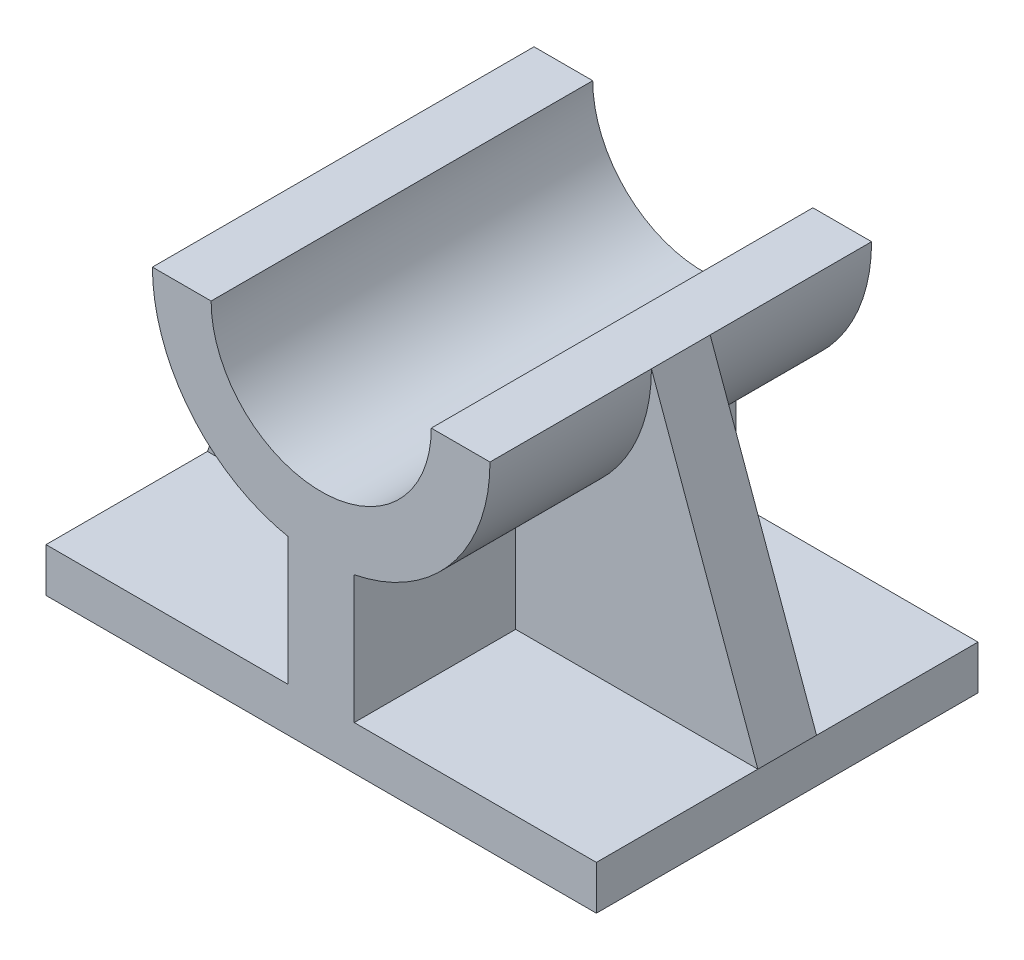
ISO-10303-21;
HEADER;
FILE_DESCRIPTION(('STEP AP214'),'2;1');
FILE_NAME('part.step','',(''),(''),'','','');
FILE_SCHEMA(('AUTOMOTIVE_DESIGN { 1 0 10303 214 1 1 1 1 }'));
ENDSEC;
DATA;
#1=APPLICATION_CONTEXT('core data for automotive mechanical design processes');
#2=APPLICATION_PROTOCOL_DEFINITION('international standard','automotive_design',2000,#1);
#3=PRODUCT_CONTEXT('',#1,'mechanical');
#4=PRODUCT('Part','Part','',(#3));
#5=PRODUCT_RELATED_PRODUCT_CATEGORY('part','',(#4));
#6=PRODUCT_DEFINITION_FORMATION('','',#4);
#7=PRODUCT_DEFINITION_CONTEXT('part definition',#1,'design');
#8=PRODUCT_DEFINITION('design','',#6,#7);
#9=PRODUCT_DEFINITION_SHAPE('','',#8);
#10=(LENGTH_UNIT() NAMED_UNIT(*) SI_UNIT(.MILLI.,.METRE.));
#11=(NAMED_UNIT(*) PLANE_ANGLE_UNIT() SI_UNIT($,.RADIAN.));
#12=(NAMED_UNIT(*) SI_UNIT($,.STERADIAN.) SOLID_ANGLE_UNIT());
#13=UNCERTAINTY_MEASURE_WITH_UNIT(LENGTH_MEASURE(1.E-05),#10,'distance_accuracy_value','');
#14=(GEOMETRIC_REPRESENTATION_CONTEXT(3) GLOBAL_UNCERTAINTY_ASSIGNED_CONTEXT((#13)) GLOBAL_UNIT_ASSIGNED_CONTEXT((#10,
#11,#12)) REPRESENTATION_CONTEXT('',''));
#15=CARTESIAN_POINT('',(0.,0.,0.));
#16=DIRECTION('',(0.,0.,1.));
#17=DIRECTION('',(1.,0.,0.));
#18=AXIS2_PLACEMENT_3D('',#15,#16,#17);
#19=CARTESIAN_POINT('',(0.,46.,-26.));
#20=DIRECTION('',(0.,0.,1.));
#21=DIRECTION('',(1.,0.,0.));
#22=AXIS2_PLACEMENT_3D('',#19,#20,#21);
#23=CYLINDRICAL_SURFACE('',#22,23.);
#24=DIRECTION('',(0.,0.,1.));
#25=VECTOR('',#24,1.);
#26=CARTESIAN_POINT('',(-4.5,23.4445128627201,-26.));
#27=LINE('',#26,#25);
#28=CARTESIAN_POINT('',(-4.5,23.4445128627201,-4.));
#29=VERTEX_POINT('',#28);
#30=CARTESIAN_POINT('',(-4.5,23.4445128627201,-26.));
#31=VERTEX_POINT('',#30);
#32=EDGE_CURVE('E201',#29,#31,#27,.F.);
#33=ORIENTED_EDGE('',*,*,#32,.F.);
#34=CARTESIAN_POINT('',(0.,46.,-4.));
#35=DIRECTION('',(0.,0.,1.));
#36=DIRECTION('',(1.,0.,0.));
#37=AXIS2_PLACEMENT_3D('',#34,#35,#36);
#38=CIRCLE('',#37,23.);
#39=CARTESIAN_POINT('',(-23.,46.,-4.));
#40=VERTEX_POINT('',#39);
#41=EDGE_CURVE('E191',#29,#40,#38,.F.);
#42=ORIENTED_EDGE('',*,*,#41,.T.);
#43=DIRECTION('',(0.,0.,1.));
#44=VECTOR('',#43,1.);
#45=CARTESIAN_POINT('',(-23.,46.,-26.));
#46=LINE('',#45,#44);
#47=CARTESIAN_POINT('',(-23.,46.,-26.));
#48=VERTEX_POINT('',#47);
#49=EDGE_CURVE('E185',#48,#40,#46,.T.);
#50=ORIENTED_EDGE('',*,*,#49,.F.);
#51=CARTESIAN_POINT('',(0.,46.,-26.));
#52=DIRECTION('',(0.,0.,1.));
#53=DIRECTION('',(1.,0.,0.));
#54=AXIS2_PLACEMENT_3D('',#51,#52,#53);
#55=CIRCLE('',#54,23.);
#56=EDGE_CURVE('E228',#48,#31,#55,.T.);
#57=ORIENTED_EDGE('',*,*,#56,.T.);
#58=EDGE_LOOP('',(#33,#42,#50,#57));
#59=FACE_BOUND('',#58,.T.);
#60=ADVANCED_FACE('F39',(#59),#23,.T.);
#61=CARTESIAN_POINT('',(0.,6.,0.));
#62=DIRECTION('',(0.,1.,0.));
#63=DIRECTION('',(0.,0.,1.));
#64=AXIS2_PLACEMENT_3D('',#61,#62,#63);
#65=PLANE('',#64);
#66=DIRECTION('',(0.,0.,1.));
#67=VECTOR('',#66,1.);
#68=CARTESIAN_POINT('',(-37.5,6.,-26.));
#69=LINE('',#68,#67);
#70=CARTESIAN_POINT('',(-37.5,6.,-26.));
#71=VERTEX_POINT('',#70);
#72=CARTESIAN_POINT('',(-37.5,6.00000000000002,-4.));
#73=VERTEX_POINT('',#72);
#74=EDGE_CURVE('E274',#71,#73,#69,.T.);
#75=ORIENTED_EDGE('',*,*,#74,.T.);
#76=DIRECTION('',(1.,0.,0.));
#77=VECTOR('',#76,1.);
#78=CARTESIAN_POINT('',(0.,6.,-4.));
#79=LINE('',#78,#77);
#80=CARTESIAN_POINT('',(-4.5,6.,-4.));
#81=VERTEX_POINT('',#80);
#82=EDGE_CURVE('E194',#73,#81,#79,.T.);
#83=ORIENTED_EDGE('',*,*,#82,.T.);
#84=DIRECTION('',(0.,0.,1.));
#85=VECTOR('',#84,1.);
#86=CARTESIAN_POINT('',(-4.5,6.,-26.));
#87=LINE('',#86,#85);
#88=CARTESIAN_POINT('',(-4.5,6.,-26.));
#89=VERTEX_POINT('',#88);
#90=EDGE_CURVE('E237',#89,#81,#87,.T.);
#91=ORIENTED_EDGE('',*,*,#90,.F.);
#92=DIRECTION('',(-1.,0.,0.));
#93=VECTOR('',#92,1.);
#94=CARTESIAN_POINT('',(-37.5,6.,-26.));
#95=LINE('',#94,#93);
#96=EDGE_CURVE('E267',#89,#71,#95,.T.);
#97=ORIENTED_EDGE('',*,*,#96,.T.);
#98=EDGE_LOOP('',(#75,#83,#91,#97));
#99=FACE_BOUND('',#98,.T.);
#100=ADVANCED_FACE('F445',(#99),#65,.T.);
#101=CARTESIAN_POINT('',(-4.5,23.,-26.));
#102=DIRECTION('',(1.,0.,0.));
#103=DIRECTION('',(0.,0.,-1.));
#104=AXIS2_PLACEMENT_3D('',#101,#102,#103);
#105=PLANE('',#104);
#106=DIRECTION('',(0.,-1.,0.));
#107=VECTOR('',#106,1.);
#108=CARTESIAN_POINT('',(-4.5,23.,-4.));
#109=LINE('',#108,#107);
#110=EDGE_CURVE('E203',#29,#81,#109,.T.);
#111=ORIENTED_EDGE('',*,*,#110,.F.);
#112=ORIENTED_EDGE('',*,*,#32,.T.);
#113=DIRECTION('',(0.,-1.,0.));
#114=VECTOR('',#113,1.);
#115=CARTESIAN_POINT('',(-4.5,23.,-26.));
#116=LINE('',#115,#114);
#117=EDGE_CURVE('E246',#31,#89,#116,.T.);
#118=ORIENTED_EDGE('',*,*,#117,.T.);
#119=ORIENTED_EDGE('',*,*,#90,.T.);
#120=EDGE_LOOP('',(#111,#112,#118,#119));
#121=FACE_BOUND('',#120,.T.);
#122=ADVANCED_FACE('F443',(#121),#105,.F.);
#123=DIRECTION('',(0.,0.,-1.));
#124=VECTOR('',#123,1.);
#125=CARTESIAN_POINT('',(4.5,6.,-26.));
#126=LINE('',#125,#124);
#127=CARTESIAN_POINT('',(4.5,6.,-4.00000000000001));
#128=VERTEX_POINT('',#127);
#129=CARTESIAN_POINT('',(4.5,6.,-26.));
#130=VERTEX_POINT('',#129);
#131=EDGE_CURVE('E241',#128,#130,#126,.T.);
#132=ORIENTED_EDGE('',*,*,#131,.F.);
#133=DIRECTION('',(1.,0.,0.));
#134=VECTOR('',#133,1.);
#135=CARTESIAN_POINT('',(0.,6.,-4.));
#136=LINE('',#135,#134);
#137=CARTESIAN_POINT('',(37.5,6.,-4.00000000000001));
#138=VERTEX_POINT('',#137);
#139=EDGE_CURVE('E63',#128,#138,#136,.T.);
#140=ORIENTED_EDGE('',*,*,#139,.T.);
#141=DIRECTION('',(0.,0.,-1.));
#142=VECTOR('',#141,1.);
#143=CARTESIAN_POINT('',(37.5,6.,-26.));
#144=LINE('',#143,#142);
#145=CARTESIAN_POINT('',(37.5,6.,-26.));
#146=VERTEX_POINT('',#145);
#147=EDGE_CURVE('E268',#138,#146,#144,.T.);
#148=ORIENTED_EDGE('',*,*,#147,.T.);
#149=EDGE_CURVE('E269',#146,#130,#95,.T.);
#150=ORIENTED_EDGE('',*,*,#149,.T.);
#151=EDGE_LOOP('',(#132,#140,#148,#150));
#152=FACE_BOUND('',#151,.T.);
#153=ADVANCED_FACE('F417',(#152),#65,.T.);
#154=CARTESIAN_POINT('',(4.5,23.,-26.));
#155=DIRECTION('',(-1.,0.,0.));
#156=DIRECTION('',(0.,0.,1.));
#157=AXIS2_PLACEMENT_3D('',#154,#155,#156);
#158=PLANE('',#157);
#159=DIRECTION('',(0.,1.,0.));
#160=VECTOR('',#159,1.);
#161=CARTESIAN_POINT('',(4.5,23.,-4.));
#162=LINE('',#161,#160);
#163=CARTESIAN_POINT('',(4.5,23.4445128627201,-4.00000000000001));
#164=VERTEX_POINT('',#163);
#165=EDGE_CURVE('E352',#128,#164,#162,.T.);
#166=ORIENTED_EDGE('',*,*,#165,.F.);
#167=ORIENTED_EDGE('',*,*,#131,.T.);
#168=DIRECTION('',(0.,-1.,0.));
#169=VECTOR('',#168,1.);
#170=CARTESIAN_POINT('',(4.5,23.,-26.));
#171=LINE('',#170,#169);
#172=CARTESIAN_POINT('',(4.5,23.4445128627201,-26.));
#173=VERTEX_POINT('',#172);
#174=EDGE_CURVE('E250',#173,#130,#171,.T.);
#175=ORIENTED_EDGE('',*,*,#174,.F.);
#176=DIRECTION('',(0.,0.,1.));
#177=VECTOR('',#176,1.);
#178=CARTESIAN_POINT('',(4.5,23.4445128627201,-26.));
#179=LINE('',#178,#177);
#180=EDGE_CURVE('E231',#173,#164,#179,.T.);
#181=ORIENTED_EDGE('',*,*,#180,.T.);
#182=EDGE_LOOP('',(#166,#167,#175,#181));
#183=FACE_BOUND('',#182,.T.);
#184=ADVANCED_FACE('F415',(#183),#158,.F.);
#185=DIRECTION('',(0.,0.,1.));
#186=VECTOR('',#185,1.);
#187=CARTESIAN_POINT('',(23.,46.,-26.));
#188=LINE('',#187,#186);
#189=CARTESIAN_POINT('',(23.,46.,-26.));
#190=VERTEX_POINT('',#189);
#191=CARTESIAN_POINT('',(23.,46.,-4.00000000000001));
#192=VERTEX_POINT('',#191);
#193=EDGE_CURVE('E215',#190,#192,#188,.T.);
#194=ORIENTED_EDGE('',*,*,#193,.T.);
#195=CARTESIAN_POINT('',(0.,46.,-4.));
#196=DIRECTION('',(0.,0.,1.));
#197=DIRECTION('',(1.,0.,0.));
#198=AXIS2_PLACEMENT_3D('',#195,#196,#197);
#199=CIRCLE('',#198,23.);
#200=EDGE_CURVE('E347',#192,#164,#199,.F.);
#201=ORIENTED_EDGE('',*,*,#200,.T.);
#202=ORIENTED_EDGE('',*,*,#180,.F.);
#203=EDGE_CURVE('E382',#173,#190,#55,.T.);
#204=ORIENTED_EDGE('',*,*,#203,.T.);
#205=EDGE_LOOP('',(#194,#201,#202,#204));
#206=FACE_BOUND('',#205,.T.);
#207=ADVANCED_FACE('F408',(#206),#23,.T.);
#208=CARTESIAN_POINT('',(0.,46.,4.));
#209=DIRECTION('',(0.,0.,1.));
#210=DIRECTION('',(1.,0.,0.));
#211=AXIS2_PLACEMENT_3D('',#208,#209,#210);
#212=CIRCLE('',#211,23.);
#213=CARTESIAN_POINT('',(-4.5,23.4445128627201,4.));
#214=VERTEX_POINT('',#213);
#215=CARTESIAN_POINT('',(-23.,46.,3.99999999999999));
#216=VERTEX_POINT('',#215);
#217=EDGE_CURVE('E447',#214,#216,#212,.F.);
#218=ORIENTED_EDGE('',*,*,#217,.F.);
#219=CARTESIAN_POINT('',(-4.5,23.4445128627201,26.));
#220=VERTEX_POINT('',#219);
#221=EDGE_CURVE('E371',#220,#214,#27,.F.);
#222=ORIENTED_EDGE('',*,*,#221,.F.);
#223=CARTESIAN_POINT('',(0.,46.,26.));
#224=DIRECTION('',(0.,0.,1.));
#225=DIRECTION('',(1.,0.,0.));
#226=AXIS2_PLACEMENT_3D('',#223,#224,#225);
#227=CIRCLE('',#226,23.);
#228=CARTESIAN_POINT('',(-23.,46.,26.));
#229=VERTEX_POINT('',#228);
#230=EDGE_CURVE('E393',#229,#220,#227,.T.);
#231=ORIENTED_EDGE('',*,*,#230,.F.);
#232=EDGE_CURVE('E186',#216,#229,#46,.T.);
#233=ORIENTED_EDGE('',*,*,#232,.F.);
#234=EDGE_LOOP('',(#218,#222,#231,#233));
#235=FACE_BOUND('',#234,.T.);
#236=ADVANCED_FACE('F473',(#235),#23,.T.);
#237=DIRECTION('',(1.,0.,0.));
#238=VECTOR('',#237,1.);
#239=CARTESIAN_POINT('',(0.,6.,4.));
#240=LINE('',#239,#238);
#241=CARTESIAN_POINT('',(-37.5,6.00000000000002,4.));
#242=VERTEX_POINT('',#241);
#243=CARTESIAN_POINT('',(-4.5,6.,4.));
#244=VERTEX_POINT('',#243);
#245=EDGE_CURVE('E457',#242,#244,#240,.T.);
#246=ORIENTED_EDGE('',*,*,#245,.F.);
#247=CARTESIAN_POINT('',(-37.5,6.,26.));
#248=VERTEX_POINT('',#247);
#249=EDGE_CURVE('E273',#242,#248,#69,.T.);
#250=ORIENTED_EDGE('',*,*,#249,.T.);
#251=DIRECTION('',(1.,0.,0.));
#252=VECTOR('',#251,1.);
#253=CARTESIAN_POINT('',(-37.5,6.,26.));
#254=LINE('',#253,#252);
#255=CARTESIAN_POINT('',(-4.5,6.,26.));
#256=VERTEX_POINT('',#255);
#257=EDGE_CURVE('E279',#248,#256,#254,.T.);
#258=ORIENTED_EDGE('',*,*,#257,.T.);
#259=EDGE_CURVE('E235',#244,#256,#87,.T.);
#260=ORIENTED_EDGE('',*,*,#259,.F.);
#261=EDGE_LOOP('',(#246,#250,#258,#260));
#262=FACE_BOUND('',#261,.T.);
#263=ADVANCED_FACE('F468',(#262),#65,.T.);
#264=CARTESIAN_POINT('',(37.5,6.,-26.));
#265=DIRECTION('',(-1.,0.,0.));
#266=DIRECTION('',(0.,0.,1.));
#267=AXIS2_PLACEMENT_3D('',#264,#265,#266);
#268=PLANE('',#267);
#269=DIRECTION('',(0.,0.,-1.));
#270=VECTOR('',#269,1.);
#271=CARTESIAN_POINT('',(37.5,0.,-26.));
#272=LINE('',#271,#270);
#273=CARTESIAN_POINT('',(37.5,0.,26.));
#274=VERTEX_POINT('',#273);
#275=CARTESIAN_POINT('',(37.5,0.,-26.));
#276=VERTEX_POINT('',#275);
#277=EDGE_CURVE('E262',#274,#276,#272,.T.);
#278=ORIENTED_EDGE('',*,*,#277,.T.);
#279=DIRECTION('',(0.,-1.,0.));
#280=VECTOR('',#279,1.);
#281=CARTESIAN_POINT('',(37.5,6.,-26.));
#282=LINE('',#281,#280);
#283=EDGE_CURVE('E11',#146,#276,#282,.T.);
#284=ORIENTED_EDGE('',*,*,#283,.F.);
#285=ORIENTED_EDGE('',*,*,#147,.F.);
#286=DIRECTION('',(0.,0.,1.));
#287=VECTOR('',#286,1.);
#288=CARTESIAN_POINT('',(37.5,6.,0.));
#289=LINE('',#288,#287);
#290=CARTESIAN_POINT('',(37.5,6.,3.99999999999999));
#291=VERTEX_POINT('',#290);
#292=EDGE_CURVE('E326',#291,#138,#289,.F.);
#293=ORIENTED_EDGE('',*,*,#292,.F.);
#294=CARTESIAN_POINT('',(37.5,6.,26.));
#295=VERTEX_POINT('',#294);
#296=EDGE_CURVE('E263',#295,#291,#144,.T.);
#297=ORIENTED_EDGE('',*,*,#296,.F.);
#298=DIRECTION('',(0.,-1.,0.));
#299=VECTOR('',#298,1.);
#300=CARTESIAN_POINT('',(37.5,6.,26.));
#301=LINE('',#300,#299);
#302=EDGE_CURVE('E283',#295,#274,#301,.T.);
#303=ORIENTED_EDGE('',*,*,#302,.T.);
#304=EDGE_LOOP('',(#278,#284,#285,#293,#297,#303));
#305=FACE_BOUND('',#304,.T.);
#306=ADVANCED_FACE('F41',(#305),#268,.F.);
#307=CARTESIAN_POINT('',(-37.5,6.,-26.));
#308=DIRECTION('',(0.,0.,1.));
#309=DIRECTION('',(1.,0.,0.));
#310=AXIS2_PLACEMENT_3D('',#307,#308,#309);
#311=PLANE('',#310);
#312=ORIENTED_EDGE('',*,*,#117,.F.);
#313=ORIENTED_EDGE('',*,*,#56,.F.);
#314=DIRECTION('',(-1.,0.,0.));
#315=VECTOR('',#314,1.);
#316=CARTESIAN_POINT('',(-23.,46.,-26.));
#317=LINE('',#316,#315);
#318=CARTESIAN_POINT('',(-15.,46.,-26.));
#319=VERTEX_POINT('',#318);
#320=EDGE_CURVE('E209',#319,#48,#317,.T.);
#321=ORIENTED_EDGE('',*,*,#320,.F.);
#322=CARTESIAN_POINT('',(0.,46.,-26.));
#323=DIRECTION('',(0.,0.,-1.));
#324=DIRECTION('',(1.,0.,0.));
#325=AXIS2_PLACEMENT_3D('',#322,#323,#324);
#326=CIRCLE('',#325,15.);
#327=CARTESIAN_POINT('',(15.,46.,-26.));
#328=VERTEX_POINT('',#327);
#329=EDGE_CURVE('E376',#328,#319,#326,.T.);
#330=ORIENTED_EDGE('',*,*,#329,.F.);
#331=DIRECTION('',(-1.,0.,0.));
#332=VECTOR('',#331,1.);
#333=CARTESIAN_POINT('',(15.,46.,-26.));
#334=LINE('',#333,#332);
#335=EDGE_CURVE('E222',#190,#328,#334,.T.);
#336=ORIENTED_EDGE('',*,*,#335,.F.);
#337=ORIENTED_EDGE('',*,*,#203,.F.);
#338=ORIENTED_EDGE('',*,*,#174,.T.);
#339=ORIENTED_EDGE('',*,*,#149,.F.);
#340=ORIENTED_EDGE('',*,*,#283,.T.);
#341=DIRECTION('',(-1.,0.,0.));
#342=VECTOR('',#341,1.);
#343=CARTESIAN_POINT('',(-37.5,0.,-26.));
#344=LINE('',#343,#342);
#345=CARTESIAN_POINT('',(-37.5,0.,-26.));
#346=VERTEX_POINT('',#345);
#347=EDGE_CURVE('E286',#276,#346,#344,.T.);
#348=ORIENTED_EDGE('',*,*,#347,.T.);
#349=DIRECTION('',(0.,-1.,0.));
#350=VECTOR('',#349,1.);
#351=CARTESIAN_POINT('',(-37.5,6.,-26.));
#352=LINE('',#351,#350);
#353=EDGE_CURVE('E48',#71,#346,#352,.T.);
#354=ORIENTED_EDGE('',*,*,#353,.F.);
#355=ORIENTED_EDGE('',*,*,#96,.F.);
#356=EDGE_LOOP('',(#312,#313,#321,#330,#336,#337,#338,#339,#340,#348,#354,#355));
#357=FACE_BOUND('',#356,.T.);
#358=ADVANCED_FACE('F438',(#357),#311,.F.);
#359=CARTESIAN_POINT('',(-37.5,6.,-26.));
#360=DIRECTION('',(1.,0.,0.));
#361=DIRECTION('',(0.,0.,-1.));
#362=AXIS2_PLACEMENT_3D('',#359,#360,#361);
#363=PLANE('',#362);
#364=ORIENTED_EDGE('',*,*,#249,.F.);
#365=DIRECTION('',(0.,0.,1.));
#366=VECTOR('',#365,1.);
#367=CARTESIAN_POINT('',(-37.5,6.00000000000002,-26.));
#368=LINE('',#367,#366);
#369=EDGE_CURVE('E354',#73,#242,#368,.T.);
#370=ORIENTED_EDGE('',*,*,#369,.F.);
#371=ORIENTED_EDGE('',*,*,#74,.F.);
#372=ORIENTED_EDGE('',*,*,#353,.T.);
#373=DIRECTION('',(0.,0.,1.));
#374=VECTOR('',#373,1.);
#375=CARTESIAN_POINT('',(-37.5,0.,-26.));
#376=LINE('',#375,#374);
#377=CARTESIAN_POINT('',(-37.5,0.,26.));
#378=VERTEX_POINT('',#377);
#379=EDGE_CURVE('E289',#346,#378,#376,.T.);
#380=ORIENTED_EDGE('',*,*,#379,.T.);
#381=DIRECTION('',(0.,-1.,0.));
#382=VECTOR('',#381,1.);
#383=CARTESIAN_POINT('',(-37.5,6.,26.));
#384=LINE('',#383,#382);
#385=EDGE_CURVE('E298',#248,#378,#384,.T.);
#386=ORIENTED_EDGE('',*,*,#385,.F.);
#387=EDGE_LOOP('',(#364,#370,#371,#372,#380,#386));
#388=FACE_BOUND('',#387,.T.);
#389=ADVANCED_FACE('F308',(#388),#363,.F.);
#390=CARTESIAN_POINT('',(-37.5,6.,26.));
#391=DIRECTION('',(0.,0.,-1.));
#392=DIRECTION('',(-1.,0.,0.));
#393=AXIS2_PLACEMENT_3D('',#390,#391,#392);
#394=PLANE('',#393);
#395=DIRECTION('',(1.,0.,0.));
#396=VECTOR('',#395,1.);
#397=CARTESIAN_POINT('',(-37.5,0.,26.));
#398=LINE('',#397,#396);
#399=EDGE_CURVE('E292',#378,#274,#398,.T.);
#400=ORIENTED_EDGE('',*,*,#399,.T.);
#401=ORIENTED_EDGE('',*,*,#302,.F.);
#402=CARTESIAN_POINT('',(4.5,6.,26.));
#403=VERTEX_POINT('',#402);
#404=EDGE_CURVE('E278',#403,#295,#254,.T.);
#405=ORIENTED_EDGE('',*,*,#404,.F.);
#406=DIRECTION('',(0.,-1.,0.));
#407=VECTOR('',#406,1.);
#408=CARTESIAN_POINT('',(4.50000000000001,23.,26.));
#409=LINE('',#408,#407);
#410=CARTESIAN_POINT('',(4.5,23.4445128627201,26.));
#411=VERTEX_POINT('',#410);
#412=EDGE_CURVE('E254',#411,#403,#409,.T.);
#413=ORIENTED_EDGE('',*,*,#412,.F.);
#414=CARTESIAN_POINT('',(23.,46.,26.));
#415=VERTEX_POINT('',#414);
#416=EDGE_CURVE('E392',#411,#415,#227,.T.);
#417=ORIENTED_EDGE('',*,*,#416,.T.);
#418=DIRECTION('',(-1.,0.,0.));
#419=VECTOR('',#418,1.);
#420=CARTESIAN_POINT('',(15.,46.,26.));
#421=LINE('',#420,#419);
#422=CARTESIAN_POINT('',(15.,46.,26.));
#423=VERTEX_POINT('',#422);
#424=EDGE_CURVE('E379',#415,#423,#421,.T.);
#425=ORIENTED_EDGE('',*,*,#424,.T.);
#426=CARTESIAN_POINT('',(0.,46.,26.));
#427=DIRECTION('',(0.,0.,-1.));
#428=DIRECTION('',(1.,0.,0.));
#429=AXIS2_PLACEMENT_3D('',#426,#427,#428);
#430=CIRCLE('',#429,15.);
#431=CARTESIAN_POINT('',(-15.,46.,26.));
#432=VERTEX_POINT('',#431);
#433=EDGE_CURVE('E375',#423,#432,#430,.T.);
#434=ORIENTED_EDGE('',*,*,#433,.T.);
#435=DIRECTION('',(-1.,0.,0.));
#436=VECTOR('',#435,1.);
#437=CARTESIAN_POINT('',(-23.,46.,26.));
#438=LINE('',#437,#436);
#439=EDGE_CURVE('E388',#432,#229,#438,.T.);
#440=ORIENTED_EDGE('',*,*,#439,.T.);
#441=ORIENTED_EDGE('',*,*,#230,.T.);
#442=DIRECTION('',(0.,-1.,0.));
#443=VECTOR('',#442,1.);
#444=CARTESIAN_POINT('',(-4.49999999999999,23.,26.));
#445=LINE('',#444,#443);
#446=EDGE_CURVE('E258',#220,#256,#445,.T.);
#447=ORIENTED_EDGE('',*,*,#446,.T.);
#448=ORIENTED_EDGE('',*,*,#257,.F.);
#449=ORIENTED_EDGE('',*,*,#385,.T.);
#450=EDGE_LOOP('',(#400,#401,#405,#413,#417,#425,#434,#440,#441,#447,#448,#449));
#451=FACE_BOUND('',#450,.T.);
#452=ADVANCED_FACE('F319',(#451),#394,.F.);
#453=DIRECTION('',(1.,0.,0.));
#454=VECTOR('',#453,1.);
#455=CARTESIAN_POINT('',(0.,6.,4.));
#456=LINE('',#455,#454);
#457=CARTESIAN_POINT('',(4.5,6.,3.99999999999999));
#458=VERTEX_POINT('',#457);
#459=EDGE_CURVE('E330',#458,#291,#456,.T.);
#460=ORIENTED_EDGE('',*,*,#459,.F.);
#461=EDGE_CURVE('E242',#403,#458,#126,.T.);
#462=ORIENTED_EDGE('',*,*,#461,.F.);
#463=ORIENTED_EDGE('',*,*,#404,.T.);
#464=ORIENTED_EDGE('',*,*,#296,.T.);
#465=EDGE_LOOP('',(#460,#462,#463,#464));
#466=FACE_BOUND('',#465,.T.);
#467=ADVANCED_FACE('F329',(#466),#65,.T.);
#468=CARTESIAN_POINT('',(0.,0.,0.));
#469=DIRECTION('',(0.,1.,0.));
#470=DIRECTION('',(0.,0.,1.));
#471=AXIS2_PLACEMENT_3D('',#468,#469,#470);
#472=PLANE('',#471);
#473=ORIENTED_EDGE('',*,*,#399,.F.);
#474=ORIENTED_EDGE('',*,*,#379,.F.);
#475=ORIENTED_EDGE('',*,*,#347,.F.);
#476=ORIENTED_EDGE('',*,*,#277,.F.);
#477=EDGE_LOOP('',(#473,#474,#475,#476));
#478=FACE_BOUND('',#477,.T.);
#479=ADVANCED_FACE('F315',(#478),#472,.F.);
#480=ORIENTED_EDGE('',*,*,#221,.T.);
#481=DIRECTION('',(0.,-1.,0.));
#482=VECTOR('',#481,1.);
#483=CARTESIAN_POINT('',(-4.5,23.,4.));
#484=LINE('',#483,#482);
#485=EDGE_CURVE('E451',#214,#244,#484,.T.);
#486=ORIENTED_EDGE('',*,*,#485,.T.);
#487=ORIENTED_EDGE('',*,*,#259,.T.);
#488=ORIENTED_EDGE('',*,*,#446,.F.);
#489=EDGE_LOOP('',(#480,#486,#487,#488));
#490=FACE_BOUND('',#489,.T.);
#491=ADVANCED_FACE('F471',(#490),#105,.F.);
#492=ORIENTED_EDGE('',*,*,#461,.T.);
#493=DIRECTION('',(0.,1.,0.));
#494=VECTOR('',#493,1.);
#495=CARTESIAN_POINT('',(4.5,23.,4.));
#496=LINE('',#495,#494);
#497=CARTESIAN_POINT('',(4.5,23.4445128627201,3.99999999999999));
#498=VERTEX_POINT('',#497);
#499=EDGE_CURVE('E338',#458,#498,#496,.T.);
#500=ORIENTED_EDGE('',*,*,#499,.T.);
#501=EDGE_CURVE('E236',#498,#411,#179,.T.);
#502=ORIENTED_EDGE('',*,*,#501,.T.);
#503=ORIENTED_EDGE('',*,*,#412,.T.);
#504=EDGE_LOOP('',(#492,#500,#502,#503));
#505=FACE_BOUND('',#504,.T.);
#506=ADVANCED_FACE('F425',(#505),#158,.F.);
#507=CARTESIAN_POINT('',(0.,46.,4.));
#508=DIRECTION('',(0.,0.,1.));
#509=DIRECTION('',(1.,0.,0.));
#510=AXIS2_PLACEMENT_3D('',#507,#508,#509);
#511=CIRCLE('',#510,23.);
#512=CARTESIAN_POINT('',(23.,46.,4.));
#513=VERTEX_POINT('',#512);
#514=EDGE_CURVE('E364',#513,#498,#511,.F.);
#515=ORIENTED_EDGE('',*,*,#514,.F.);
#516=EDGE_CURVE('E211',#513,#415,#188,.T.);
#517=ORIENTED_EDGE('',*,*,#516,.T.);
#518=ORIENTED_EDGE('',*,*,#416,.F.);
#519=ORIENTED_EDGE('',*,*,#501,.F.);
#520=EDGE_LOOP('',(#515,#517,#518,#519));
#521=FACE_BOUND('',#520,.T.);
#522=ADVANCED_FACE('F430',(#521),#23,.T.);
#523=CARTESIAN_POINT('',(0.,46.,-26.));
#524=DIRECTION('',(0.,0.,1.));
#525=DIRECTION('',(1.,0.,0.));
#526=AXIS2_PLACEMENT_3D('',#523,#524,#525);
#527=CYLINDRICAL_SURFACE('',#526,15.);
#528=ORIENTED_EDGE('',*,*,#433,.F.);
#529=DIRECTION('',(0.,0.,1.));
#530=VECTOR('',#529,1.);
#531=CARTESIAN_POINT('',(15.,46.,-26.));
#532=LINE('',#531,#530);
#533=EDGE_CURVE('E400',#328,#423,#532,.T.);
#534=ORIENTED_EDGE('',*,*,#533,.F.);
#535=ORIENTED_EDGE('',*,*,#329,.T.);
#536=DIRECTION('',(0.,0.,1.));
#537=VECTOR('',#536,1.);
#538=CARTESIAN_POINT('',(-15.,46.,-26.));
#539=LINE('',#538,#537);
#540=EDGE_CURVE('E218',#319,#432,#539,.T.);
#541=ORIENTED_EDGE('',*,*,#540,.T.);
#542=EDGE_LOOP('',(#528,#534,#535,#541));
#543=FACE_BOUND('',#542,.T.);
#544=ADVANCED_FACE('F474',(#543),#527,.F.);
#545=CARTESIAN_POINT('',(15.,46.,-26.));
#546=DIRECTION('',(0.,1.,0.));
#547=DIRECTION('',(0.,0.,1.));
#548=AXIS2_PLACEMENT_3D('',#545,#546,#547);
#549=PLANE('',#548);
#550=ORIENTED_EDGE('',*,*,#516,.F.);
#551=EDGE_CURVE('E213',#192,#513,#188,.T.);
#552=ORIENTED_EDGE('',*,*,#551,.F.);
#553=ORIENTED_EDGE('',*,*,#193,.F.);
#554=ORIENTED_EDGE('',*,*,#335,.T.);
#555=ORIENTED_EDGE('',*,*,#533,.T.);
#556=ORIENTED_EDGE('',*,*,#424,.F.);
#557=EDGE_LOOP('',(#550,#552,#553,#554,#555,#556));
#558=FACE_BOUND('',#557,.T.);
#559=ADVANCED_FACE('F475',(#558),#549,.T.);
#560=CARTESIAN_POINT('',(-23.,46.,-26.));
#561=DIRECTION('',(0.,1.,0.));
#562=DIRECTION('',(0.,0.,1.));
#563=AXIS2_PLACEMENT_3D('',#560,#561,#562);
#564=PLANE('',#563);
#565=ORIENTED_EDGE('',*,*,#439,.F.);
#566=ORIENTED_EDGE('',*,*,#540,.F.);
#567=ORIENTED_EDGE('',*,*,#320,.T.);
#568=ORIENTED_EDGE('',*,*,#49,.T.);
#569=EDGE_CURVE('E177',#40,#216,#46,.T.);
#570=ORIENTED_EDGE('',*,*,#569,.T.);
#571=ORIENTED_EDGE('',*,*,#232,.T.);
#572=EDGE_LOOP('',(#565,#566,#567,#568,#570,#571));
#573=FACE_BOUND('',#572,.T.);
#574=ADVANCED_FACE('F207',(#573),#564,.T.);
#575=CARTESIAN_POINT('',(23.,46.,0.));
#576=DIRECTION('',(-0.940136065162483,-0.3407993236214,0.));
#577=DIRECTION('',(0.3407993236214,-0.940136065162483,0.));
#578=AXIS2_PLACEMENT_3D('',#575,#576,#577);
#579=PLANE('',#578);
#580=DIRECTION('',(0.3407993236214,-0.940136065162483,0.));
#581=VECTOR('',#580,1.);
#582=CARTESIAN_POINT('',(23.,46.,4.));
#583=LINE('',#582,#581);
#584=EDGE_CURVE('E337',#513,#291,#583,.T.);
#585=ORIENTED_EDGE('',*,*,#584,.T.);
#586=ORIENTED_EDGE('',*,*,#292,.T.);
#587=DIRECTION('',(0.3407993236214,-0.940136065162483,0.));
#588=VECTOR('',#587,1.);
#589=CARTESIAN_POINT('',(23.,46.,-4.));
#590=LINE('',#589,#588);
#591=EDGE_CURVE('E348',#192,#138,#590,.T.);
#592=ORIENTED_EDGE('',*,*,#591,.F.);
#593=ORIENTED_EDGE('',*,*,#551,.T.);
#594=EDGE_LOOP('',(#585,#586,#592,#593));
#595=FACE_BOUND('',#594,.T.);
#596=ADVANCED_FACE('F343',(#595),#579,.F.);
#597=CARTESIAN_POINT('',(0.,23.,4.));
#598=DIRECTION('',(0.,0.,1.));
#599=DIRECTION('',(1.,0.,0.));
#600=AXIS2_PLACEMENT_3D('',#597,#598,#599);
#601=PLANE('',#600);
#602=ORIENTED_EDGE('',*,*,#499,.F.);
#603=ORIENTED_EDGE('',*,*,#459,.T.);
#604=ORIENTED_EDGE('',*,*,#584,.F.);
#605=ORIENTED_EDGE('',*,*,#514,.T.);
#606=EDGE_LOOP('',(#602,#603,#604,#605));
#607=FACE_BOUND('',#606,.T.);
#608=ADVANCED_FACE('F335',(#607),#601,.T.);
#609=CARTESIAN_POINT('',(0.,23.,-4.));
#610=DIRECTION('',(0.,0.,1.));
#611=DIRECTION('',(1.,0.,0.));
#612=AXIS2_PLACEMENT_3D('',#609,#610,#611);
#613=PLANE('',#612);
#614=ORIENTED_EDGE('',*,*,#139,.F.);
#615=ORIENTED_EDGE('',*,*,#165,.T.);
#616=ORIENTED_EDGE('',*,*,#200,.F.);
#617=ORIENTED_EDGE('',*,*,#591,.T.);
#618=EDGE_LOOP('',(#614,#615,#616,#617));
#619=FACE_BOUND('',#618,.T.);
#620=ADVANCED_FACE('F413',(#619),#613,.F.);
#621=CARTESIAN_POINT('',(-23.,46.,0.));
#622=DIRECTION('',(-0.940136065162483,0.3407993236214,0.));
#623=DIRECTION('',(-0.3407993236214,-0.940136065162483,0.));
#624=AXIS2_PLACEMENT_3D('',#621,#622,#623);
#625=PLANE('',#624);
#626=DIRECTION('',(-0.3407993236214,-0.940136065162483,0.));
#627=VECTOR('',#626,1.);
#628=CARTESIAN_POINT('',(-23.,46.,-4.));
#629=LINE('',#628,#627);
#630=EDGE_CURVE('E180',#40,#73,#629,.T.);
#631=ORIENTED_EDGE('',*,*,#630,.T.);
#632=ORIENTED_EDGE('',*,*,#369,.T.);
#633=DIRECTION('',(-0.3407993236214,-0.940136065162483,0.));
#634=VECTOR('',#633,1.);
#635=CARTESIAN_POINT('',(-23.,46.,4.));
#636=LINE('',#635,#634);
#637=EDGE_CURVE('E55',#216,#242,#636,.T.);
#638=ORIENTED_EDGE('',*,*,#637,.F.);
#639=ORIENTED_EDGE('',*,*,#569,.F.);
#640=EDGE_LOOP('',(#631,#632,#638,#639));
#641=FACE_BOUND('',#640,.T.);
#642=ADVANCED_FACE('F179',(#641),#625,.T.);
#643=CARTESIAN_POINT('',(0.,23.,-4.));
#644=DIRECTION('',(0.,0.,1.));
#645=DIRECTION('',(1.,0.,0.));
#646=AXIS2_PLACEMENT_3D('',#643,#644,#645);
#647=PLANE('',#646);
#648=ORIENTED_EDGE('',*,*,#82,.F.);
#649=ORIENTED_EDGE('',*,*,#630,.F.);
#650=ORIENTED_EDGE('',*,*,#41,.F.);
#651=ORIENTED_EDGE('',*,*,#110,.T.);
#652=EDGE_LOOP('',(#648,#649,#650,#651));
#653=FACE_BOUND('',#652,.T.);
#654=ADVANCED_FACE('F190',(#653),#647,.F.);
#655=CARTESIAN_POINT('',(0.,23.,4.));
#656=DIRECTION('',(0.,0.,1.));
#657=DIRECTION('',(1.,0.,0.));
#658=AXIS2_PLACEMENT_3D('',#655,#656,#657);
#659=PLANE('',#658);
#660=ORIENTED_EDGE('',*,*,#637,.T.);
#661=ORIENTED_EDGE('',*,*,#245,.T.);
#662=ORIENTED_EDGE('',*,*,#485,.F.);
#663=ORIENTED_EDGE('',*,*,#217,.T.);
#664=EDGE_LOOP('',(#660,#661,#662,#663));
#665=FACE_BOUND('',#664,.T.);
#666=ADVANCED_FACE('F462',(#665),#659,.T.);
#667=CLOSED_SHELL('',(#60,#100,#122,#153,#184,#207,#236,#263,#306,#358,#389,#452,#467,#479,#491,
#506,#522,#544,#559,#574,#596,#608,#620,#642,#654,#666));
#668=MANIFOLD_SOLID_BREP('B2',#667);
#669=ADVANCED_BREP_SHAPE_REPRESENTATION('',(#18,#668),#14);
#670=SHAPE_DEFINITION_REPRESENTATION(#9,#669);
ENDSEC;
END-ISO-10303-21;
